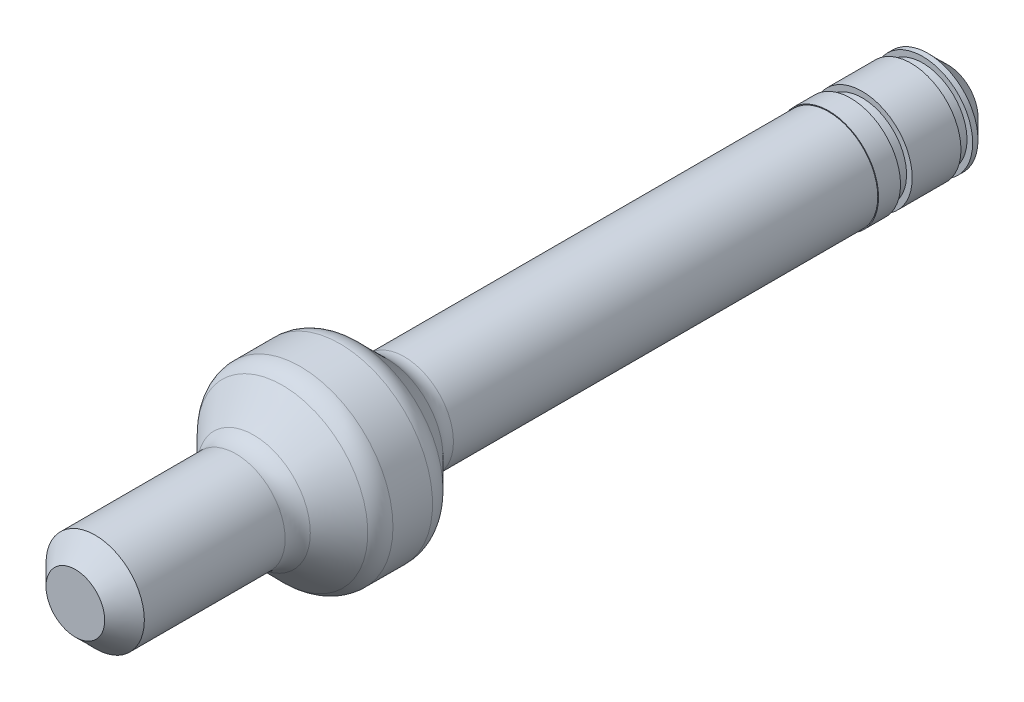
ISO-10303-21;
HEADER;
FILE_DESCRIPTION(('STEP AP214'),'2;1');
FILE_NAME('part.step','',(''),(''),'','','');
FILE_SCHEMA(('AUTOMOTIVE_DESIGN { 1 0 10303 214 1 1 1 1 }'));
ENDSEC;
DATA;
#1=APPLICATION_CONTEXT('core data for automotive mechanical design processes');
#2=APPLICATION_PROTOCOL_DEFINITION('international standard','automotive_design',2000,#1);
#3=PRODUCT_CONTEXT('',#1,'mechanical');
#4=PRODUCT('Part','Part','',(#3));
#5=PRODUCT_RELATED_PRODUCT_CATEGORY('part','',(#4));
#6=PRODUCT_DEFINITION_FORMATION('','',#4);
#7=PRODUCT_DEFINITION_CONTEXT('part definition',#1,'design');
#8=PRODUCT_DEFINITION('design','',#6,#7);
#9=PRODUCT_DEFINITION_SHAPE('','',#8);
#10=(LENGTH_UNIT() NAMED_UNIT(*) SI_UNIT(.MILLI.,.METRE.));
#11=(NAMED_UNIT(*) PLANE_ANGLE_UNIT() SI_UNIT($,.RADIAN.));
#12=(NAMED_UNIT(*) SI_UNIT($,.STERADIAN.) SOLID_ANGLE_UNIT());
#13=UNCERTAINTY_MEASURE_WITH_UNIT(LENGTH_MEASURE(1.E-05),#10,'distance_accuracy_value','');
#14=(GEOMETRIC_REPRESENTATION_CONTEXT(3) GLOBAL_UNCERTAINTY_ASSIGNED_CONTEXT((#13)) GLOBAL_UNIT_ASSIGNED_CONTEXT((#10,
#11,#12)) REPRESENTATION_CONTEXT('',''));
#15=CARTESIAN_POINT('',(0.,0.,0.));
#16=DIRECTION('',(0.,0.,1.));
#17=DIRECTION('',(1.,0.,0.));
#18=AXIS2_PLACEMENT_3D('',#15,#16,#17);
#19=CARTESIAN_POINT('',(0.,3.1496,-39.572));
#20=DIRECTION('',(0.,0.,1.));
#21=DIRECTION('',(1.,0.,0.));
#22=AXIS2_PLACEMENT_3D('',#19,#20,#21);
#23=PLANE('',#22);
#24=CARTESIAN_POINT('',(0.,0.,-39.572000000021));
#25=DIRECTION('',(0.,0.,1.));
#26=DIRECTION('',(1.,0.,0.));
#27=AXIS2_PLACEMENT_3D('',#24,#25,#26);
#28=CIRCLE('',#27,1.89960000000156);
#29=CARTESIAN_POINT('',(1.89960000000156,0.,-39.572000000021));
#30=VERTEX_POINT('',#29);
#31=EDGE_CURVE('E18',#30,#30,#28,.T.);
#32=ORIENTED_EDGE('',*,*,#31,.F.);
#33=EDGE_LOOP('',(#32));
#34=FACE_BOUND('',#33,.T.);
#35=ADVANCED_FACE('F15',(#34),#23,.F.);
#36=CARTESIAN_POINT('',(0.,0.,-38.3219999999937));
#37=DIRECTION('',(0.,0.,1.));
#38=DIRECTION('',(1.,0.,0.));
#39=AXIS2_PLACEMENT_3D('',#36,#37,#38);
#40=CONICAL_SURFACE('',#39,3.149599999972,0.785398163374711);
#41=ORIENTED_EDGE('',*,*,#31,.T.);
#42=EDGE_LOOP('',(#41));
#43=FACE_BOUND('',#42,.T.);
#44=CARTESIAN_POINT('',(0.,0.,-38.322));
#45=DIRECTION('',(0.,0.,1.));
#46=DIRECTION('',(1.,0.,0.));
#47=AXIS2_PLACEMENT_3D('',#44,#45,#46);
#48=CIRCLE('',#47,3.1496);
#49=CARTESIAN_POINT('',(3.1496,0.,-38.322));
#50=VERTEX_POINT('',#49);
#51=EDGE_CURVE('E184',#50,#50,#48,.T.);
#52=ORIENTED_EDGE('',*,*,#51,.F.);
#53=EDGE_LOOP('',(#52));
#54=FACE_BOUND('',#53,.T.);
#55=ADVANCED_FACE('F118',(#43,#54),#40,.T.);
#56=CARTESIAN_POINT('',(0.,0.,26.453846));
#57=DIRECTION('',(0.,0.,1.));
#58=DIRECTION('',(1.,0.,0.));
#59=AXIS2_PLACEMENT_3D('',#56,#57,#58);
#60=CYLINDRICAL_SURFACE('',#59,3.1496);
#61=ORIENTED_EDGE('',*,*,#51,.T.);
#62=EDGE_LOOP('',(#61));
#63=FACE_BOUND('',#62,.T.);
#64=CARTESIAN_POINT('',(0.,0.,-37.9845));
#65=DIRECTION('',(0.,0.,1.));
#66=DIRECTION('',(1.,0.,0.));
#67=AXIS2_PLACEMENT_3D('',#64,#65,#66);
#68=CIRCLE('',#67,3.1496);
#69=CARTESIAN_POINT('',(3.1496,0.,-37.9845));
#70=VERTEX_POINT('',#69);
#71=EDGE_CURVE('E182',#70,#70,#68,.F.);
#72=ORIENTED_EDGE('',*,*,#71,.T.);
#73=EDGE_LOOP('',(#72));
#74=FACE_BOUND('',#73,.T.);
#75=ADVANCED_FACE('F115',(#63,#74),#60,.T.);
#76=CARTESIAN_POINT('',(0.,3.1,15.428));
#77=DIRECTION('',(0.,0.,-1.));
#78=DIRECTION('',(-1.,0.,0.));
#79=AXIS2_PLACEMENT_3D('',#76,#77,#78);
#80=PLANE('',#79);
#81=CARTESIAN_POINT('',(0.,0.,15.4279999999858));
#82=DIRECTION('',(0.,0.,-1.));
#83=DIRECTION('',(-1.,0.,0.));
#84=AXIS2_PLACEMENT_3D('',#81,#82,#83);
#85=CIRCLE('',#84,1.84999999999036);
#86=CARTESIAN_POINT('',(-1.84999999999036,0.,15.4279999999858));
#87=VERTEX_POINT('',#86);
#88=EDGE_CURVE('E180',#87,#87,#85,.T.);
#89=ORIENTED_EDGE('',*,*,#88,.F.);
#90=EDGE_LOOP('',(#89));
#91=FACE_BOUND('',#90,.T.);
#92=ADVANCED_FACE('F111',(#91),#80,.F.);
#93=CARTESIAN_POINT('',(0.,2.794,-37.9845));
#94=DIRECTION('',(0.,0.,-1.));
#95=DIRECTION('',(-1.,0.,0.));
#96=AXIS2_PLACEMENT_3D('',#93,#94,#95);
#97=PLANE('',#96);
#98=CARTESIAN_POINT('',(0.,0.,-37.9845));
#99=DIRECTION('',(0.,0.,-1.));
#100=DIRECTION('',(-1.,0.,0.));
#101=AXIS2_PLACEMENT_3D('',#98,#99,#100);
#102=CIRCLE('',#101,2.794);
#103=CARTESIAN_POINT('',(-2.794,0.,-37.9845));
#104=VERTEX_POINT('',#103);
#105=EDGE_CURVE('E177',#104,#104,#102,.F.);
#106=ORIENTED_EDGE('',*,*,#105,.F.);
#107=EDGE_LOOP('',(#106));
#108=FACE_BOUND('',#107,.T.);
#109=ORIENTED_EDGE('',*,*,#71,.F.);
#110=EDGE_LOOP('',(#109));
#111=FACE_BOUND('',#110,.T.);
#112=ADVANCED_FACE('F107',(#108,#111),#97,.F.);
#113=CARTESIAN_POINT('',(0.,0.,14.1780000000153));
#114=DIRECTION('',(0.,0.,-1.));
#115=DIRECTION('',(-1.,0.,0.));
#116=AXIS2_PLACEMENT_3D('',#113,#114,#115);
#117=CONICAL_SURFACE('',#116,3.10000000001764,0.785398163420186);
#118=ORIENTED_EDGE('',*,*,#88,.T.);
#119=EDGE_LOOP('',(#118));
#120=FACE_BOUND('',#119,.T.);
#121=CARTESIAN_POINT('',(0.,0.,14.178));
#122=DIRECTION('',(0.,0.,1.));
#123=DIRECTION('',(1.,0.,0.));
#124=AXIS2_PLACEMENT_3D('',#121,#122,#123);
#125=CIRCLE('',#124,3.1);
#126=CARTESIAN_POINT('',(3.1,0.,14.178));
#127=VERTEX_POINT('',#126);
#128=EDGE_CURVE('E176',#127,#127,#125,.F.);
#129=ORIENTED_EDGE('',*,*,#128,.F.);
#130=EDGE_LOOP('',(#129));
#131=FACE_BOUND('',#130,.T.);
#132=ADVANCED_FACE('F103',(#120,#131),#117,.T.);
#133=CARTESIAN_POINT('',(0.,0.,-40.0654390361338));
#134=DIRECTION('',(0.,0.,-1.));
#135=DIRECTION('',(-1.,0.,0.));
#136=AXIS2_PLACEMENT_3D('',#133,#134,#135);
#137=CYLINDRICAL_SURFACE('',#136,2.794);
#138=ORIENTED_EDGE('',*,*,#105,.T.);
#139=EDGE_LOOP('',(#138));
#140=FACE_BOUND('',#139,.T.);
#141=CARTESIAN_POINT('',(0.,0.,-37.2479));
#142=DIRECTION('',(0.,0.,-1.));
#143=DIRECTION('',(-1.,0.,0.));
#144=AXIS2_PLACEMENT_3D('',#141,#142,#143);
#145=CIRCLE('',#144,2.794);
#146=CARTESIAN_POINT('',(-2.794,0.,-37.2479));
#147=VERTEX_POINT('',#146);
#148=EDGE_CURVE('E173',#147,#147,#145,.T.);
#149=ORIENTED_EDGE('',*,*,#148,.T.);
#150=EDGE_LOOP('',(#149));
#151=FACE_BOUND('',#150,.T.);
#152=ADVANCED_FACE('F99',(#140,#151),#137,.T.);
#153=CARTESIAN_POINT('',(0.,0.,26.453846));
#154=DIRECTION('',(0.,0.,1.));
#155=DIRECTION('',(1.,0.,0.));
#156=AXIS2_PLACEMENT_3D('',#153,#154,#155);
#157=CYLINDRICAL_SURFACE('',#156,3.1);
#158=CARTESIAN_POINT('',(0.,0.,5.30456403026728));
#159=DIRECTION('',(0.,0.,1.));
#160=DIRECTION('',(1.,0.,0.));
#161=AXIS2_PLACEMENT_3D('',#158,#159,#160);
#162=CIRCLE('',#161,3.1);
#163=CARTESIAN_POINT('',(3.1,0.,5.30456403026728));
#164=VERTEX_POINT('',#163);
#165=EDGE_CURVE('E83',#164,#164,#162,.T.);
#166=ORIENTED_EDGE('',*,*,#165,.T.);
#167=EDGE_LOOP('',(#166));
#168=FACE_BOUND('',#167,.T.);
#169=ORIENTED_EDGE('',*,*,#128,.T.);
#170=EDGE_LOOP('',(#169));
#171=FACE_BOUND('',#170,.T.);
#172=ADVANCED_FACE('F95',(#168,#171),#157,.T.);
#173=CARTESIAN_POINT('',(0.,2.794,-37.2479));
#174=DIRECTION('',(0.,0.,1.));
#175=DIRECTION('',(1.,0.,0.));
#176=AXIS2_PLACEMENT_3D('',#173,#174,#175);
#177=PLANE('',#176);
#178=CARTESIAN_POINT('',(0.,0.,-37.2479));
#179=DIRECTION('',(0.,0.,1.));
#180=DIRECTION('',(1.,0.,0.));
#181=AXIS2_PLACEMENT_3D('',#178,#179,#180);
#182=CIRCLE('',#181,3.1496);
#183=CARTESIAN_POINT('',(3.1496,0.,-37.2479));
#184=VERTEX_POINT('',#183);
#185=EDGE_CURVE('E80',#184,#184,#182,.T.);
#186=ORIENTED_EDGE('',*,*,#185,.F.);
#187=EDGE_LOOP('',(#186));
#188=FACE_BOUND('',#187,.T.);
#189=ORIENTED_EDGE('',*,*,#148,.F.);
#190=EDGE_LOOP('',(#189));
#191=FACE_BOUND('',#190,.T.);
#192=ADVANCED_FACE('F91',(#188,#191),#177,.F.);
#193=CARTESIAN_POINT('',(0.,0.,5.30456403026728));
#194=DIRECTION('',(0.,0.,1.));
#195=DIRECTION('',(1.,0.,0.));
#196=AXIS2_PLACEMENT_3D('',#193,#194,#195);
#197=TOROIDAL_SURFACE('',#196,4.6875,1.5875);
#198=CARTESIAN_POINT('',(0.,0.,4.18203201513734));
#199=DIRECTION('',(0.,0.,-1.));
#200=DIRECTION('',(-1.,0.,0.));
#201=AXIS2_PLACEMENT_3D('',#198,#199,#200);
#202=CIRCLE('',#201,3.5649679848575);
#203=CARTESIAN_POINT('',(-3.5649679848575,0.,4.18203201513734));
#204=VERTEX_POINT('',#203);
#205=EDGE_CURVE('E77',#204,#204,#202,.T.);
#206=ORIENTED_EDGE('',*,*,#205,.F.);
#207=EDGE_LOOP('',(#206));
#208=FACE_BOUND('',#207,.T.);
#209=ORIENTED_EDGE('',*,*,#165,.F.);
#210=EDGE_LOOP('',(#209));
#211=FACE_BOUND('',#210,.T.);
#212=ADVANCED_FACE('F86',(#208,#211),#197,.F.);
#213=CARTESIAN_POINT('',(0.,0.,26.453846));
#214=DIRECTION('',(0.,0.,1.));
#215=DIRECTION('',(1.,0.,0.));
#216=AXIS2_PLACEMENT_3D('',#213,#214,#215);
#217=CYLINDRICAL_SURFACE('',#216,3.1496);
#218=ORIENTED_EDGE('',*,*,#185,.T.);
#219=EDGE_LOOP('',(#218));
#220=FACE_BOUND('',#219,.T.);
#221=CARTESIAN_POINT('',(0.,0.,-34.1745));
#222=DIRECTION('',(0.,0.,1.));
#223=DIRECTION('',(1.,0.,0.));
#224=AXIS2_PLACEMENT_3D('',#221,#222,#223);
#225=CIRCLE('',#224,3.1496);
#226=CARTESIAN_POINT('',(3.1496,0.,-34.1745));
#227=VERTEX_POINT('',#226);
#228=EDGE_CURVE('E76',#227,#227,#225,.F.);
#229=ORIENTED_EDGE('',*,*,#228,.T.);
#230=EDGE_LOOP('',(#229));
#231=FACE_BOUND('',#230,.T.);
#232=ADVANCED_FACE('F90',(#220,#231),#217,.T.);
#233=CARTESIAN_POINT('',(0.,0.,2.36996798503242));
#234=DIRECTION('',(0.,0.,-1.));
#235=DIRECTION('',(-1.,0.,0.));
#236=AXIS2_PLACEMENT_3D('',#233,#234,#235);
#237=CONICAL_SURFACE('',#236,5.37703201501927,0.785398163413133);
#238=ORIENTED_EDGE('',*,*,#205,.T.);
#239=EDGE_LOOP('',(#238));
#240=FACE_BOUND('',#239,.T.);
#241=CARTESIAN_POINT('',(0.,0.,2.36996798486636));
#242=DIRECTION('',(0.,0.,-1.));
#243=DIRECTION('',(-1.,0.,0.));
#244=AXIS2_PLACEMENT_3D('',#241,#242,#243);
#245=CIRCLE('',#244,5.37703201513364);
#246=CARTESIAN_POINT('',(-5.37703201513364,0.,2.36996798486636));
#247=VERTEX_POINT('',#246);
#248=EDGE_CURVE('E72',#247,#247,#245,.T.);
#249=ORIENTED_EDGE('',*,*,#248,.F.);
#250=EDGE_LOOP('',(#249));
#251=FACE_BOUND('',#250,.T.);
#252=ADVANCED_FACE('F217',(#240,#251),#237,.T.);
#253=CARTESIAN_POINT('',(0.,3.1496,-34.1745));
#254=DIRECTION('',(0.,0.,-1.));
#255=DIRECTION('',(-1.,0.,0.));
#256=AXIS2_PLACEMENT_3D('',#253,#254,#255);
#257=PLANE('',#256);
#258=CARTESIAN_POINT('',(0.,0.,-34.1745));
#259=DIRECTION('',(0.,0.,-1.));
#260=DIRECTION('',(-1.,0.,0.));
#261=AXIS2_PLACEMENT_3D('',#258,#259,#260);
#262=CIRCLE('',#261,2.794);
#263=CARTESIAN_POINT('',(-2.794,0.,-34.1745));
#264=VERTEX_POINT('',#263);
#265=EDGE_CURVE('E75',#264,#264,#262,.F.);
#266=ORIENTED_EDGE('',*,*,#265,.F.);
#267=EDGE_LOOP('',(#266));
#268=FACE_BOUND('',#267,.T.);
#269=ORIENTED_EDGE('',*,*,#228,.F.);
#270=EDGE_LOOP('',(#269));
#271=FACE_BOUND('',#270,.T.);
#272=ADVANCED_FACE('F65',(#268,#271),#257,.F.);
#273=CARTESIAN_POINT('',(0.,0.,1.24743596973271));
#274=DIRECTION('',(0.,0.,-1.));
#275=DIRECTION('',(-1.,0.,0.));
#276=AXIS2_PLACEMENT_3D('',#273,#274,#275);
#277=TOROIDAL_SURFACE('',#276,4.2545,1.5875);
#278=CARTESIAN_POINT('',(0.,0.,1.24743596973271));
#279=DIRECTION('',(0.,0.,1.));
#280=DIRECTION('',(1.,0.,0.));
#281=AXIS2_PLACEMENT_3D('',#278,#279,#280);
#282=CIRCLE('',#281,5.842);
#283=CARTESIAN_POINT('',(5.842,0.,1.24743596973271));
#284=VERTEX_POINT('',#283);
#285=EDGE_CURVE('E71',#284,#284,#282,.F.);
#286=ORIENTED_EDGE('',*,*,#285,.F.);
#287=EDGE_LOOP('',(#286));
#288=FACE_BOUND('',#287,.T.);
#289=ORIENTED_EDGE('',*,*,#248,.T.);
#290=EDGE_LOOP('',(#289));
#291=FACE_BOUND('',#290,.T.);
#292=ADVANCED_FACE('F60',(#288,#291),#277,.T.);
#293=CARTESIAN_POINT('',(0.,0.,-40.0654390361338));
#294=DIRECTION('',(0.,0.,-1.));
#295=DIRECTION('',(-1.,0.,0.));
#296=AXIS2_PLACEMENT_3D('',#293,#294,#295);
#297=CYLINDRICAL_SURFACE('',#296,2.794);
#298=ORIENTED_EDGE('',*,*,#265,.T.);
#299=EDGE_LOOP('',(#298));
#300=FACE_BOUND('',#299,.T.);
#301=CARTESIAN_POINT('',(0.,0.,-33.4379));
#302=DIRECTION('',(0.,0.,-1.));
#303=DIRECTION('',(-1.,0.,0.));
#304=AXIS2_PLACEMENT_3D('',#301,#302,#303);
#305=CIRCLE('',#304,2.794);
#306=CARTESIAN_POINT('',(-2.794,0.,-33.4379));
#307=VERTEX_POINT('',#306);
#308=EDGE_CURVE('E157',#307,#307,#305,.T.);
#309=ORIENTED_EDGE('',*,*,#308,.T.);
#310=EDGE_LOOP('',(#309));
#311=FACE_BOUND('',#310,.T.);
#312=ADVANCED_FACE('F56',(#300,#311),#297,.T.);
#313=CARTESIAN_POINT('',(0.,0.,26.453846));
#314=DIRECTION('',(0.,0.,1.));
#315=DIRECTION('',(1.,0.,0.));
#316=AXIS2_PLACEMENT_3D('',#313,#314,#315);
#317=CYLINDRICAL_SURFACE('',#316,5.842);
#318=CARTESIAN_POINT('',(0.,0.,-1.24743596973272));
#319=DIRECTION('',(0.,0.,-1.));
#320=DIRECTION('',(-1.,0.,0.));
#321=AXIS2_PLACEMENT_3D('',#318,#319,#320);
#322=CIRCLE('',#321,5.842);
#323=CARTESIAN_POINT('',(-5.842,0.,-1.24743596973272));
#324=VERTEX_POINT('',#323);
#325=EDGE_CURVE('E39',#324,#324,#322,.T.);
#326=ORIENTED_EDGE('',*,*,#325,.F.);
#327=EDGE_LOOP('',(#326));
#328=FACE_BOUND('',#327,.T.);
#329=ORIENTED_EDGE('',*,*,#285,.T.);
#330=EDGE_LOOP('',(#329));
#331=FACE_BOUND('',#330,.T.);
#332=ADVANCED_FACE('F52',(#328,#331),#317,.T.);
#333=CARTESIAN_POINT('',(0.,3.1496,-33.4379));
#334=DIRECTION('',(0.,0.,1.));
#335=DIRECTION('',(1.,0.,0.));
#336=AXIS2_PLACEMENT_3D('',#333,#334,#335);
#337=PLANE('',#336);
#338=CARTESIAN_POINT('',(0.,0.,-33.4379));
#339=DIRECTION('',(0.,0.,1.));
#340=DIRECTION('',(1.,0.,0.));
#341=AXIS2_PLACEMENT_3D('',#338,#339,#340);
#342=CIRCLE('',#341,3.1496);
#343=CARTESIAN_POINT('',(3.1496,0.,-33.4379));
#344=VERTEX_POINT('',#343);
#345=EDGE_CURVE('E36',#344,#344,#342,.T.);
#346=ORIENTED_EDGE('',*,*,#345,.F.);
#347=EDGE_LOOP('',(#346));
#348=FACE_BOUND('',#347,.T.);
#349=ORIENTED_EDGE('',*,*,#308,.F.);
#350=EDGE_LOOP('',(#349));
#351=FACE_BOUND('',#350,.T.);
#352=ADVANCED_FACE('F47',(#348,#351),#337,.F.);
#353=CARTESIAN_POINT('',(0.,0.,-1.24743596973272));
#354=DIRECTION('',(0.,0.,-1.));
#355=DIRECTION('',(-1.,0.,0.));
#356=AXIS2_PLACEMENT_3D('',#353,#354,#355);
#357=TOROIDAL_SURFACE('',#356,4.2545,1.5875);
#358=CARTESIAN_POINT('',(0.,0.,-2.36996798486189));
#359=DIRECTION('',(0.,0.,1.));
#360=DIRECTION('',(1.,0.,0.));
#361=AXIS2_PLACEMENT_3D('',#358,#359,#360);
#362=CIRCLE('',#361,5.37703201513295);
#363=CARTESIAN_POINT('',(5.37703201513295,0.,-2.36996798486189));
#364=VERTEX_POINT('',#363);
#365=EDGE_CURVE('E32',#364,#364,#362,.F.);
#366=ORIENTED_EDGE('',*,*,#365,.F.);
#367=EDGE_LOOP('',(#366));
#368=FACE_BOUND('',#367,.T.);
#369=ORIENTED_EDGE('',*,*,#325,.T.);
#370=EDGE_LOOP('',(#369));
#371=FACE_BOUND('',#370,.T.);
#372=ADVANCED_FACE('F42',(#368,#371),#357,.T.);
#373=CARTESIAN_POINT('',(0.,0.,26.453846));
#374=DIRECTION('',(0.,0.,1.));
#375=DIRECTION('',(1.,0.,0.));
#376=AXIS2_PLACEMENT_3D('',#373,#374,#375);
#377=CYLINDRICAL_SURFACE('',#376,3.1496);
#378=CARTESIAN_POINT('',(0.,0.,-32.0536));
#379=DIRECTION('',(0.,0.,1.));
#380=DIRECTION('',(1.,0.,0.));
#381=AXIS2_PLACEMENT_3D('',#378,#379,#380);
#382=CIRCLE('',#381,3.1496);
#383=CARTESIAN_POINT('',(3.1496,0.,-32.0536));
#384=VERTEX_POINT('',#383);
#385=EDGE_CURVE('E35',#384,#384,#382,.F.);
#386=ORIENTED_EDGE('',*,*,#385,.T.);
#387=EDGE_LOOP('',(#386));
#388=FACE_BOUND('',#387,.T.);
#389=ORIENTED_EDGE('',*,*,#345,.T.);
#390=EDGE_LOOP('',(#389));
#391=FACE_BOUND('',#390,.T.);
#392=ADVANCED_FACE('F46',(#388,#391),#377,.T.);
#393=CARTESIAN_POINT('',(0.,0.,-2.36996798486189));
#394=DIRECTION('',(0.,0.,1.));
#395=DIRECTION('',(1.,0.,0.));
#396=AXIS2_PLACEMENT_3D('',#393,#394,#395);
#397=CONICAL_SURFACE('',#396,5.37703201513295,0.785398163381764);
#398=CARTESIAN_POINT('',(0.,0.,-4.18203201513368));
#399=DIRECTION('',(0.,0.,1.));
#400=DIRECTION('',(1.,0.,0.));
#401=AXIS2_PLACEMENT_3D('',#398,#399,#400);
#402=CIRCLE('',#401,3.56496798486635);
#403=CARTESIAN_POINT('',(3.56496798486635,0.,-4.18203201513368));
#404=VERTEX_POINT('',#403);
#405=EDGE_CURVE('E27',#404,#404,#402,.T.);
#406=ORIENTED_EDGE('',*,*,#405,.T.);
#407=EDGE_LOOP('',(#406));
#408=FACE_BOUND('',#407,.T.);
#409=ORIENTED_EDGE('',*,*,#365,.T.);
#410=EDGE_LOOP('',(#409));
#411=FACE_BOUND('',#410,.T.);
#412=ADVANCED_FACE('F142',(#408,#411),#397,.T.);
#413=CARTESIAN_POINT('',(0.,3.1496,-32.0536));
#414=DIRECTION('',(0.,0.,-1.));
#415=DIRECTION('',(-1.,0.,0.));
#416=AXIS2_PLACEMENT_3D('',#413,#414,#415);
#417=PLANE('',#416);
#418=ORIENTED_EDGE('',*,*,#385,.F.);
#419=EDGE_LOOP('',(#418));
#420=FACE_BOUND('',#419,.T.);
#421=CARTESIAN_POINT('',(0.,0.,-32.0536));
#422=DIRECTION('',(0.,0.,1.));
#423=DIRECTION('',(1.,0.,0.));
#424=AXIS2_PLACEMENT_3D('',#421,#422,#423);
#425=CIRCLE('',#424,3.1);
#426=CARTESIAN_POINT('',(3.1,0.,-32.0536));
#427=VERTEX_POINT('',#426);
#428=EDGE_CURVE('E22',#427,#427,#425,.T.);
#429=ORIENTED_EDGE('',*,*,#428,.F.);
#430=EDGE_LOOP('',(#429));
#431=FACE_BOUND('',#430,.T.);
#432=ADVANCED_FACE('F137',(#420,#431),#417,.F.);
#433=CARTESIAN_POINT('',(0.,0.,-5.30456403026731));
#434=DIRECTION('',(0.,0.,1.));
#435=DIRECTION('',(1.,0.,0.));
#436=AXIS2_PLACEMENT_3D('',#433,#434,#435);
#437=TOROIDAL_SURFACE('',#436,4.6875,1.5875);
#438=ORIENTED_EDGE('',*,*,#405,.F.);
#439=EDGE_LOOP('',(#438));
#440=FACE_BOUND('',#439,.T.);
#441=CARTESIAN_POINT('',(0.,0.,-5.30456403026731));
#442=DIRECTION('',(0.,0.,1.));
#443=DIRECTION('',(1.,0.,0.));
#444=AXIS2_PLACEMENT_3D('',#441,#442,#443);
#445=CIRCLE('',#444,3.1);
#446=CARTESIAN_POINT('',(3.1,0.,-5.30456403026731));
#447=VERTEX_POINT('',#446);
#448=EDGE_CURVE('E10',#447,#447,#445,.F.);
#449=ORIENTED_EDGE('',*,*,#448,.F.);
#450=EDGE_LOOP('',(#449));
#451=FACE_BOUND('',#450,.T.);
#452=ADVANCED_FACE('F131',(#440,#451),#437,.F.);
#453=CARTESIAN_POINT('',(0.,0.,26.453846));
#454=DIRECTION('',(0.,0.,1.));
#455=DIRECTION('',(1.,0.,0.));
#456=AXIS2_PLACEMENT_3D('',#453,#454,#455);
#457=CYLINDRICAL_SURFACE('',#456,3.1);
#458=ORIENTED_EDGE('',*,*,#428,.T.);
#459=EDGE_LOOP('',(#458));
#460=FACE_BOUND('',#459,.T.);
#461=ORIENTED_EDGE('',*,*,#448,.T.);
#462=EDGE_LOOP('',(#461));
#463=FACE_BOUND('',#462,.T.);
#464=ADVANCED_FACE('F129',(#460,#463),#457,.T.);
#465=CLOSED_SHELL('',(#35,#55,#75,#92,#112,#132,#152,#172,#192,#212,#232,#252,#272,#292,#312,
#332,#352,#372,#392,#412,#432,#452,#464));
#466=MANIFOLD_SOLID_BREP('B1',#465);
#467=ADVANCED_BREP_SHAPE_REPRESENTATION('',(#18,#466),#14);
#468=SHAPE_DEFINITION_REPRESENTATION(#9,#467);
ENDSEC;
END-ISO-10303-21;
